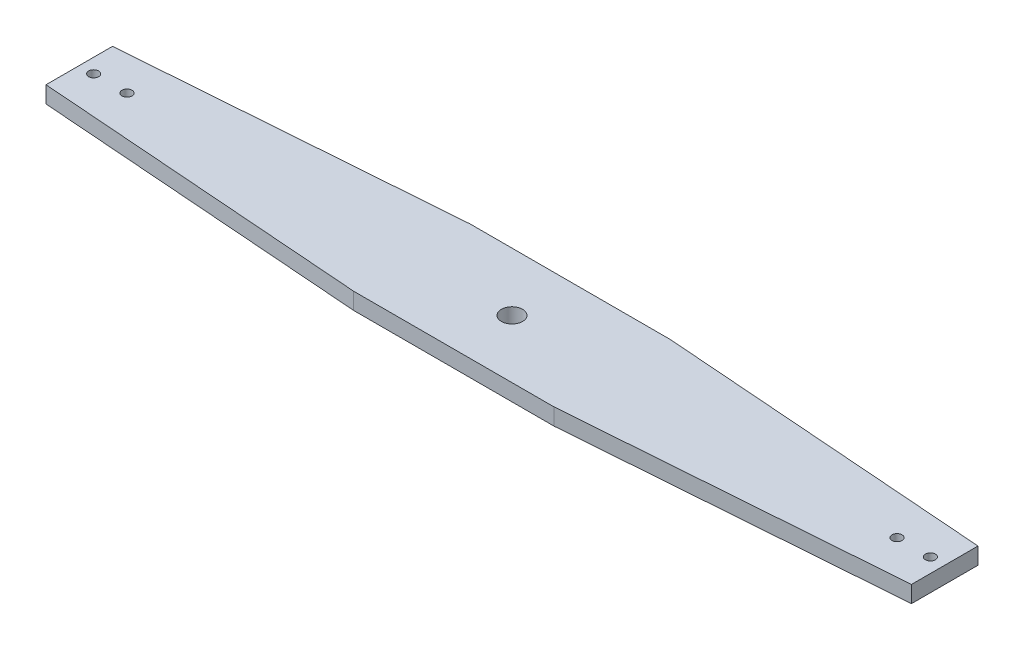
ISO-10303-21;
HEADER;
FILE_DESCRIPTION(('STEP AP214'),'2;1');
FILE_NAME('part.step','',(''),(''),'','','');
FILE_SCHEMA(('AUTOMOTIVE_DESIGN { 1 0 10303 214 1 1 1 1 }'));
ENDSEC;
DATA;
#1=APPLICATION_CONTEXT('core data for automotive mechanical design processes');
#2=APPLICATION_PROTOCOL_DEFINITION('international standard','automotive_design',2000,#1);
#3=PRODUCT_CONTEXT('',#1,'mechanical');
#4=PRODUCT('Part','Part','',(#3));
#5=PRODUCT_RELATED_PRODUCT_CATEGORY('part','',(#4));
#6=PRODUCT_DEFINITION_FORMATION('','',#4);
#7=PRODUCT_DEFINITION_CONTEXT('part definition',#1,'design');
#8=PRODUCT_DEFINITION('design','',#6,#7);
#9=PRODUCT_DEFINITION_SHAPE('','',#8);
#10=(LENGTH_UNIT() NAMED_UNIT(*) SI_UNIT(.MILLI.,.METRE.));
#11=(NAMED_UNIT(*) PLANE_ANGLE_UNIT() SI_UNIT($,.RADIAN.));
#12=(NAMED_UNIT(*) SI_UNIT($,.STERADIAN.) SOLID_ANGLE_UNIT());
#13=UNCERTAINTY_MEASURE_WITH_UNIT(LENGTH_MEASURE(1.E-05),#10,'distance_accuracy_value','');
#14=(GEOMETRIC_REPRESENTATION_CONTEXT(3) GLOBAL_UNCERTAINTY_ASSIGNED_CONTEXT((#13)) GLOBAL_UNIT_ASSIGNED_CONTEXT((#10,
#11,#12)) REPRESENTATION_CONTEXT('',''));
#15=CARTESIAN_POINT('',(0.,0.,0.));
#16=DIRECTION('',(0.,0.,1.));
#17=DIRECTION('',(1.,0.,0.));
#18=AXIS2_PLACEMENT_3D('',#15,#16,#17);
#19=CARTESIAN_POINT('',(0.,10.,0.));
#20=DIRECTION('',(0.,1.,0.));
#21=DIRECTION('',(0.,0.,1.));
#22=AXIS2_PLACEMENT_3D('',#19,#20,#21);
#23=PLANE('',#22);
#24=CARTESIAN_POINT('',(0.,10.,0.));
#25=DIRECTION('',(0.,1.,0.));
#26=DIRECTION('',(0.,0.,1.));
#27=AXIS2_PLACEMENT_3D('',#24,#25,#26);
#28=CIRCLE('',#27,6.34999999999999);
#29=CARTESIAN_POINT('',(0.,10.,6.34999999999999));
#30=VERTEX_POINT('',#29);
#31=EDGE_CURVE('E203',#30,#30,#28,.T.);
#32=ORIENTED_EDGE('',*,*,#31,.F.);
#33=EDGE_LOOP('',(#32));
#34=FACE_BOUND('',#33,.T.);
#35=CARTESIAN_POINT('',(250.825,10.,0.));
#36=DIRECTION('',(0.,1.,0.));
#37=DIRECTION('',(0.,0.,1.));
#38=AXIS2_PLACEMENT_3D('',#35,#36,#37);
#39=CIRCLE('',#38,2.99999999999999);
#40=CARTESIAN_POINT('',(250.825,10.,2.9999999999999));
#41=VERTEX_POINT('',#40);
#42=EDGE_CURVE('E191',#41,#41,#39,.T.);
#43=ORIENTED_EDGE('',*,*,#42,.F.);
#44=EDGE_LOOP('',(#43));
#45=FACE_BOUND('',#44,.T.);
#46=DIRECTION('',(-0.997190603750812,0.,0.0749059396249192));
#47=VECTOR('',#46,1.);
#48=CARTESIAN_POINT('',(-60.,10.,-34.9250000000001));
#49=LINE('',#48,#47);
#50=CARTESIAN_POINT('',(-60.,10.,-34.9250000000001));
#51=VERTEX_POINT('',#50);
#52=CARTESIAN_POINT('',(-259.438120750162,10.,-19.9438120750162));
#53=VERTEX_POINT('',#52);
#54=EDGE_CURVE('E154',#51,#53,#49,.T.);
#55=ORIENTED_EDGE('',*,*,#54,.T.);
#56=DIRECTION('',(0.,0.,1.));
#57=VECTOR('',#56,1.);
#58=CARTESIAN_POINT('',(-259.438120750162,10.,-19.9438120750162));
#59=LINE('',#58,#57);
#60=CARTESIAN_POINT('',(-259.438120750162,10.,19.9438120750162));
#61=VERTEX_POINT('',#60);
#62=EDGE_CURVE('E102',#53,#61,#59,.T.);
#63=ORIENTED_EDGE('',*,*,#62,.T.);
#64=DIRECTION('',(0.997190603750811,0.,0.0749059396249187));
#65=VECTOR('',#64,1.);
#66=CARTESIAN_POINT('',(-259.438120750162,10.,19.9438120750162));
#67=LINE('',#66,#65);
#68=CARTESIAN_POINT('',(-60.,10.,34.925));
#69=VERTEX_POINT('',#68);
#70=EDGE_CURVE('E169',#61,#69,#67,.T.);
#71=ORIENTED_EDGE('',*,*,#70,.T.);
#72=DIRECTION('',(1.,0.,0.));
#73=VECTOR('',#72,1.);
#74=CARTESIAN_POINT('',(-60.,10.,34.925));
#75=LINE('',#74,#73);
#76=CARTESIAN_POINT('',(60.,10.,34.925));
#77=VERTEX_POINT('',#76);
#78=EDGE_CURVE('E182',#69,#77,#75,.T.);
#79=ORIENTED_EDGE('',*,*,#78,.T.);
#80=DIRECTION('',(0.997190603750811,0.,-0.0749059396249172));
#81=VECTOR('',#80,1.);
#82=CARTESIAN_POINT('',(60.,10.,34.925));
#83=LINE('',#82,#81);
#84=CARTESIAN_POINT('',(259.438120750162,10.,19.9438120750165));
#85=VERTEX_POINT('',#84);
#86=EDGE_CURVE('E121',#77,#85,#83,.T.);
#87=ORIENTED_EDGE('',*,*,#86,.T.);
#88=DIRECTION('',(0.,0.,-1.));
#89=VECTOR('',#88,1.);
#90=CARTESIAN_POINT('',(259.438120750162,10.,-19.943812075016));
#91=LINE('',#90,#89);
#92=CARTESIAN_POINT('',(259.438120750162,10.,-19.943812075016));
#93=VERTEX_POINT('',#92);
#94=EDGE_CURVE('E115',#85,#93,#91,.T.);
#95=ORIENTED_EDGE('',*,*,#94,.T.);
#96=DIRECTION('',(-0.997190603750811,0.,-0.0749059396249203));
#97=VECTOR('',#96,1.);
#98=CARTESIAN_POINT('',(60.,10.,-34.9250000000001));
#99=LINE('',#98,#97);
#100=CARTESIAN_POINT('',(60.,10.,-34.9250000000001));
#101=VERTEX_POINT('',#100);
#102=EDGE_CURVE('E119',#93,#101,#99,.T.);
#103=ORIENTED_EDGE('',*,*,#102,.T.);
#104=DIRECTION('',(-1.,0.,0.));
#105=VECTOR('',#104,1.);
#106=CARTESIAN_POINT('',(-60.,10.,-34.9250000000001));
#107=LINE('',#106,#105);
#108=EDGE_CURVE('E59',#101,#51,#107,.T.);
#109=ORIENTED_EDGE('',*,*,#108,.T.);
#110=EDGE_LOOP('',(#55,#63,#71,#79,#87,#95,#103,#109));
#111=FACE_BOUND('',#110,.T.);
#112=CARTESIAN_POINT('',(-250.825,10.,0.));
#113=DIRECTION('',(0.,1.,0.));
#114=DIRECTION('',(0.,0.,1.));
#115=AXIS2_PLACEMENT_3D('',#112,#113,#114);
#116=CIRCLE('',#115,2.99999999999999);
#117=CARTESIAN_POINT('',(-250.825,10.,2.99999999999999));
#118=VERTEX_POINT('',#117);
#119=EDGE_CURVE('E143',#118,#118,#116,.T.);
#120=ORIENTED_EDGE('',*,*,#119,.F.);
#121=EDGE_LOOP('',(#120));
#122=FACE_BOUND('',#121,.T.);
#123=CARTESIAN_POINT('',(-230.825,10.,0.));
#124=DIRECTION('',(0.,1.,0.));
#125=DIRECTION('',(0.,0.,1.));
#126=AXIS2_PLACEMENT_3D('',#123,#124,#125);
#127=CIRCLE('',#126,2.99999999999999);
#128=CARTESIAN_POINT('',(-230.825,10.,2.99999999999999));
#129=VERTEX_POINT('',#128);
#130=EDGE_CURVE('E197',#129,#129,#127,.T.);
#131=ORIENTED_EDGE('',*,*,#130,.F.);
#132=EDGE_LOOP('',(#131));
#133=FACE_BOUND('',#132,.T.);
#134=CARTESIAN_POINT('',(230.825,10.,0.));
#135=DIRECTION('',(0.,1.,0.));
#136=DIRECTION('',(0.,0.,1.));
#137=AXIS2_PLACEMENT_3D('',#134,#135,#136);
#138=CIRCLE('',#137,2.99999999999999);
#139=CARTESIAN_POINT('',(230.825,10.,3.));
#140=VERTEX_POINT('',#139);
#141=EDGE_CURVE('E209',#140,#140,#138,.T.);
#142=ORIENTED_EDGE('',*,*,#141,.F.);
#143=EDGE_LOOP('',(#142));
#144=FACE_BOUND('',#143,.T.);
#145=ADVANCED_FACE('F42',(#34,#45,#111,#122,#133,#144),#23,.T.);
#146=CARTESIAN_POINT('',(0.,0.,0.));
#147=DIRECTION('',(0.,1.,0.));
#148=DIRECTION('',(0.,0.,1.));
#149=AXIS2_PLACEMENT_3D('',#146,#147,#148);
#150=PLANE('',#149);
#151=DIRECTION('',(-0.997190603750812,0.,0.0749059396249192));
#152=VECTOR('',#151,1.);
#153=CARTESIAN_POINT('',(-60.,0.,-34.9250000000001));
#154=LINE('',#153,#152);
#155=CARTESIAN_POINT('',(-60.,0.,-34.9250000000001));
#156=VERTEX_POINT('',#155);
#157=CARTESIAN_POINT('',(-259.438120750162,0.,-19.9438120750162));
#158=VERTEX_POINT('',#157);
#159=EDGE_CURVE('E139',#156,#158,#154,.T.);
#160=ORIENTED_EDGE('',*,*,#159,.F.);
#161=DIRECTION('',(-1.,0.,0.));
#162=VECTOR('',#161,1.);
#163=CARTESIAN_POINT('',(-60.,0.,-34.9250000000001));
#164=LINE('',#163,#162);
#165=CARTESIAN_POINT('',(60.,0.,-34.9250000000001));
#166=VERTEX_POINT('',#165);
#167=EDGE_CURVE('E94',#166,#156,#164,.T.);
#168=ORIENTED_EDGE('',*,*,#167,.F.);
#169=DIRECTION('',(-0.997190603750811,0.,-0.0749059396249203));
#170=VECTOR('',#169,1.);
#171=CARTESIAN_POINT('',(60.,0.,-34.9250000000001));
#172=LINE('',#171,#170);
#173=CARTESIAN_POINT('',(259.438120750162,0.,-19.943812075016));
#174=VERTEX_POINT('',#173);
#175=EDGE_CURVE('E88',#174,#166,#172,.T.);
#176=ORIENTED_EDGE('',*,*,#175,.F.);
#177=DIRECTION('',(0.,0.,-1.));
#178=VECTOR('',#177,1.);
#179=CARTESIAN_POINT('',(259.438120750162,0.,-19.943812075016));
#180=LINE('',#179,#178);
#181=CARTESIAN_POINT('',(259.438120750162,0.,19.9438120750165));
#182=VERTEX_POINT('',#181);
#183=EDGE_CURVE('E129',#182,#174,#180,.T.);
#184=ORIENTED_EDGE('',*,*,#183,.F.);
#185=DIRECTION('',(0.997190603750811,0.,-0.0749059396249172));
#186=VECTOR('',#185,1.);
#187=CARTESIAN_POINT('',(60.,0.,34.925));
#188=LINE('',#187,#186);
#189=CARTESIAN_POINT('',(60.,0.,34.925));
#190=VERTEX_POINT('',#189);
#191=EDGE_CURVE('E149',#190,#182,#188,.T.);
#192=ORIENTED_EDGE('',*,*,#191,.F.);
#193=DIRECTION('',(1.,0.,0.));
#194=VECTOR('',#193,1.);
#195=CARTESIAN_POINT('',(-60.,0.,34.925));
#196=LINE('',#195,#194);
#197=CARTESIAN_POINT('',(-60.,0.,34.925));
#198=VERTEX_POINT('',#197);
#199=EDGE_CURVE('E147',#198,#190,#196,.T.);
#200=ORIENTED_EDGE('',*,*,#199,.F.);
#201=DIRECTION('',(0.997190603750811,0.,0.0749059396249187));
#202=VECTOR('',#201,1.);
#203=CARTESIAN_POINT('',(-259.438120750162,0.,19.9438120750162));
#204=LINE('',#203,#202);
#205=CARTESIAN_POINT('',(-259.438120750162,0.,19.9438120750162));
#206=VERTEX_POINT('',#205);
#207=EDGE_CURVE('E145',#206,#198,#204,.T.);
#208=ORIENTED_EDGE('',*,*,#207,.F.);
#209=DIRECTION('',(0.,0.,1.));
#210=VECTOR('',#209,1.);
#211=CARTESIAN_POINT('',(-259.438120750162,0.,-19.9438120750162));
#212=LINE('',#211,#210);
#213=EDGE_CURVE('E142',#158,#206,#212,.T.);
#214=ORIENTED_EDGE('',*,*,#213,.F.);
#215=EDGE_LOOP('',(#160,#168,#176,#184,#192,#200,#208,#214));
#216=FACE_BOUND('',#215,.T.);
#217=CARTESIAN_POINT('',(-250.825,0.,0.));
#218=DIRECTION('',(0.,1.,0.));
#219=DIRECTION('',(0.,0.,1.));
#220=AXIS2_PLACEMENT_3D('',#217,#218,#219);
#221=CIRCLE('',#220,2.99999999999999);
#222=CARTESIAN_POINT('',(-250.825,0.,2.99999999999999));
#223=VERTEX_POINT('',#222);
#224=EDGE_CURVE('E188',#223,#223,#221,.T.);
#225=ORIENTED_EDGE('',*,*,#224,.T.);
#226=EDGE_LOOP('',(#225));
#227=FACE_BOUND('',#226,.T.);
#228=CARTESIAN_POINT('',(250.825,0.,0.));
#229=DIRECTION('',(0.,1.,0.));
#230=DIRECTION('',(0.,0.,1.));
#231=AXIS2_PLACEMENT_3D('',#228,#229,#230);
#232=CIRCLE('',#231,2.99999999999999);
#233=CARTESIAN_POINT('',(250.825,0.,2.9999999999999));
#234=VERTEX_POINT('',#233);
#235=EDGE_CURVE('E194',#234,#234,#232,.T.);
#236=ORIENTED_EDGE('',*,*,#235,.T.);
#237=EDGE_LOOP('',(#236));
#238=FACE_BOUND('',#237,.T.);
#239=CARTESIAN_POINT('',(-230.825,0.,0.));
#240=DIRECTION('',(0.,1.,0.));
#241=DIRECTION('',(0.,0.,1.));
#242=AXIS2_PLACEMENT_3D('',#239,#240,#241);
#243=CIRCLE('',#242,2.99999999999999);
#244=CARTESIAN_POINT('',(-230.825,0.,2.99999999999999));
#245=VERTEX_POINT('',#244);
#246=EDGE_CURVE('E200',#245,#245,#243,.T.);
#247=ORIENTED_EDGE('',*,*,#246,.T.);
#248=EDGE_LOOP('',(#247));
#249=FACE_BOUND('',#248,.T.);
#250=CARTESIAN_POINT('',(0.,0.,0.));
#251=DIRECTION('',(0.,1.,0.));
#252=DIRECTION('',(0.,0.,1.));
#253=AXIS2_PLACEMENT_3D('',#250,#251,#252);
#254=CIRCLE('',#253,6.34999999999999);
#255=CARTESIAN_POINT('',(0.,0.,6.34999999999999));
#256=VERTEX_POINT('',#255);
#257=EDGE_CURVE('E206',#256,#256,#254,.T.);
#258=ORIENTED_EDGE('',*,*,#257,.T.);
#259=EDGE_LOOP('',(#258));
#260=FACE_BOUND('',#259,.T.);
#261=CARTESIAN_POINT('',(230.825,0.,0.));
#262=DIRECTION('',(0.,1.,0.));
#263=DIRECTION('',(0.,0.,1.));
#264=AXIS2_PLACEMENT_3D('',#261,#262,#263);
#265=CIRCLE('',#264,2.99999999999999);
#266=CARTESIAN_POINT('',(230.825,0.,3.));
#267=VERTEX_POINT('',#266);
#268=EDGE_CURVE('E212',#267,#267,#265,.T.);
#269=ORIENTED_EDGE('',*,*,#268,.T.);
#270=EDGE_LOOP('',(#269));
#271=FACE_BOUND('',#270,.T.);
#272=ADVANCED_FACE('F173',(#216,#227,#238,#249,#260,#271),#150,.F.);
#273=CARTESIAN_POINT('',(-60.,10.,-34.9250000000001));
#274=DIRECTION('',(0.0749059396249192,0.,0.997190603750812));
#275=DIRECTION('',(0.997190603750812,0.,-0.0749059396249192));
#276=AXIS2_PLACEMENT_3D('',#273,#274,#275);
#277=PLANE('',#276);
#278=ORIENTED_EDGE('',*,*,#159,.T.);
#279=DIRECTION('',(0.,-1.,0.));
#280=VECTOR('',#279,1.);
#281=CARTESIAN_POINT('',(-259.438120750162,10.,-19.9438120750162));
#282=LINE('',#281,#280);
#283=EDGE_CURVE('E11',#53,#158,#282,.T.);
#284=ORIENTED_EDGE('',*,*,#283,.F.);
#285=ORIENTED_EDGE('',*,*,#54,.F.);
#286=DIRECTION('',(0.,-1.,0.));
#287=VECTOR('',#286,1.);
#288=CARTESIAN_POINT('',(-60.,10.,-34.9250000000001));
#289=LINE('',#288,#287);
#290=EDGE_CURVE('E135',#51,#156,#289,.T.);
#291=ORIENTED_EDGE('',*,*,#290,.T.);
#292=EDGE_LOOP('',(#278,#284,#285,#291));
#293=FACE_BOUND('',#292,.T.);
#294=ADVANCED_FACE('F44',(#293),#277,.F.);
#295=CARTESIAN_POINT('',(-259.438120750162,10.,-19.9438120750162));
#296=DIRECTION('',(1.,0.,0.));
#297=DIRECTION('',(0.,0.,-1.));
#298=AXIS2_PLACEMENT_3D('',#295,#296,#297);
#299=PLANE('',#298);
#300=ORIENTED_EDGE('',*,*,#213,.T.);
#301=DIRECTION('',(0.,-1.,0.));
#302=VECTOR('',#301,1.);
#303=CARTESIAN_POINT('',(-259.438120750162,10.,19.9438120750162));
#304=LINE('',#303,#302);
#305=EDGE_CURVE('E51',#61,#206,#304,.T.);
#306=ORIENTED_EDGE('',*,*,#305,.F.);
#307=ORIENTED_EDGE('',*,*,#62,.F.);
#308=ORIENTED_EDGE('',*,*,#283,.T.);
#309=EDGE_LOOP('',(#300,#306,#307,#308));
#310=FACE_BOUND('',#309,.T.);
#311=ADVANCED_FACE('F246',(#310),#299,.F.);
#312=CARTESIAN_POINT('',(-259.438120750162,10.,19.9438120750162));
#313=DIRECTION('',(0.0749059396249187,0.,-0.997190603750812));
#314=DIRECTION('',(-0.997190603750812,0.,-0.0749059396249187));
#315=AXIS2_PLACEMENT_3D('',#312,#313,#314);
#316=PLANE('',#315);
#317=ORIENTED_EDGE('',*,*,#207,.T.);
#318=DIRECTION('',(0.,-1.,0.));
#319=VECTOR('',#318,1.);
#320=CARTESIAN_POINT('',(-60.,10.,34.925));
#321=LINE('',#320,#319);
#322=EDGE_CURVE('E161',#69,#198,#321,.T.);
#323=ORIENTED_EDGE('',*,*,#322,.F.);
#324=ORIENTED_EDGE('',*,*,#70,.F.);
#325=ORIENTED_EDGE('',*,*,#305,.T.);
#326=EDGE_LOOP('',(#317,#323,#324,#325));
#327=FACE_BOUND('',#326,.T.);
#328=ADVANCED_FACE('F167',(#327),#316,.F.);
#329=CARTESIAN_POINT('',(-60.,10.,34.925));
#330=DIRECTION('',(0.,0.,-1.));
#331=DIRECTION('',(-1.,0.,0.));
#332=AXIS2_PLACEMENT_3D('',#329,#330,#331);
#333=PLANE('',#332);
#334=ORIENTED_EDGE('',*,*,#199,.T.);
#335=DIRECTION('',(0.,-1.,0.));
#336=VECTOR('',#335,1.);
#337=CARTESIAN_POINT('',(60.,10.,34.925));
#338=LINE('',#337,#336);
#339=EDGE_CURVE('E158',#77,#190,#338,.T.);
#340=ORIENTED_EDGE('',*,*,#339,.F.);
#341=ORIENTED_EDGE('',*,*,#78,.F.);
#342=ORIENTED_EDGE('',*,*,#322,.T.);
#343=EDGE_LOOP('',(#334,#340,#341,#342));
#344=FACE_BOUND('',#343,.T.);
#345=ADVANCED_FACE('F178',(#344),#333,.F.);
#346=CARTESIAN_POINT('',(60.,10.,34.925));
#347=DIRECTION('',(-0.0749059396249172,0.,-0.997190603750812));
#348=DIRECTION('',(-0.997190603750812,0.,0.0749059396249172));
#349=AXIS2_PLACEMENT_3D('',#346,#347,#348);
#350=PLANE('',#349);
#351=ORIENTED_EDGE('',*,*,#191,.T.);
#352=DIRECTION('',(0.,-1.,0.));
#353=VECTOR('',#352,1.);
#354=CARTESIAN_POINT('',(259.438120750162,10.,19.9438120750165));
#355=LINE('',#354,#353);
#356=EDGE_CURVE('E130',#85,#182,#355,.T.);
#357=ORIENTED_EDGE('',*,*,#356,.F.);
#358=ORIENTED_EDGE('',*,*,#86,.F.);
#359=ORIENTED_EDGE('',*,*,#339,.T.);
#360=EDGE_LOOP('',(#351,#357,#358,#359));
#361=FACE_BOUND('',#360,.T.);
#362=ADVANCED_FACE('F181',(#361),#350,.F.);
#363=CARTESIAN_POINT('',(259.438120750162,10.,-19.943812075016));
#364=DIRECTION('',(-1.,0.,0.));
#365=DIRECTION('',(0.,0.,1.));
#366=AXIS2_PLACEMENT_3D('',#363,#364,#365);
#367=PLANE('',#366);
#368=ORIENTED_EDGE('',*,*,#183,.T.);
#369=DIRECTION('',(0.,-1.,0.));
#370=VECTOR('',#369,1.);
#371=CARTESIAN_POINT('',(259.438120750162,10.,-19.943812075016));
#372=LINE('',#371,#370);
#373=EDGE_CURVE('E126',#93,#174,#372,.T.);
#374=ORIENTED_EDGE('',*,*,#373,.F.);
#375=ORIENTED_EDGE('',*,*,#94,.F.);
#376=ORIENTED_EDGE('',*,*,#356,.T.);
#377=EDGE_LOOP('',(#368,#374,#375,#376));
#378=FACE_BOUND('',#377,.T.);
#379=ADVANCED_FACE('F127',(#378),#367,.F.);
#380=CARTESIAN_POINT('',(60.,10.,-34.9250000000001));
#381=DIRECTION('',(-0.0749059396249203,0.,0.997190603750812));
#382=DIRECTION('',(0.997190603750811,0.,0.0749059396249203));
#383=AXIS2_PLACEMENT_3D('',#380,#381,#382);
#384=PLANE('',#383);
#385=ORIENTED_EDGE('',*,*,#175,.T.);
#386=DIRECTION('',(0.,-1.,0.));
#387=VECTOR('',#386,1.);
#388=CARTESIAN_POINT('',(60.,10.,-34.9250000000001));
#389=LINE('',#388,#387);
#390=EDGE_CURVE('E131',#101,#166,#389,.T.);
#391=ORIENTED_EDGE('',*,*,#390,.F.);
#392=ORIENTED_EDGE('',*,*,#102,.F.);
#393=ORIENTED_EDGE('',*,*,#373,.T.);
#394=EDGE_LOOP('',(#385,#391,#392,#393));
#395=FACE_BOUND('',#394,.T.);
#396=ADVANCED_FACE('F133',(#395),#384,.F.);
#397=CARTESIAN_POINT('',(-60.,10.,-34.9250000000001));
#398=DIRECTION('',(0.,0.,1.));
#399=DIRECTION('',(1.,0.,0.));
#400=AXIS2_PLACEMENT_3D('',#397,#398,#399);
#401=PLANE('',#400);
#402=ORIENTED_EDGE('',*,*,#167,.T.);
#403=ORIENTED_EDGE('',*,*,#290,.F.);
#404=ORIENTED_EDGE('',*,*,#108,.F.);
#405=ORIENTED_EDGE('',*,*,#390,.T.);
#406=EDGE_LOOP('',(#402,#403,#404,#405));
#407=FACE_BOUND('',#406,.T.);
#408=ADVANCED_FACE('F234',(#407),#401,.F.);
#409=CARTESIAN_POINT('',(-250.825,10.,0.));
#410=DIRECTION('',(0.,-1.,0.));
#411=DIRECTION('',(0.,0.,-1.));
#412=AXIS2_PLACEMENT_3D('',#409,#410,#411);
#413=CYLINDRICAL_SURFACE('',#412,2.99999999999999);
#414=ORIENTED_EDGE('',*,*,#119,.T.);
#415=EDGE_LOOP('',(#414));
#416=FACE_BOUND('',#415,.T.);
#417=ORIENTED_EDGE('',*,*,#224,.F.);
#418=EDGE_LOOP('',(#417));
#419=FACE_BOUND('',#418,.T.);
#420=ADVANCED_FACE('F231',(#416,#419),#413,.F.);
#421=CARTESIAN_POINT('',(250.825,10.,0.));
#422=DIRECTION('',(0.,-1.,0.));
#423=DIRECTION('',(0.,0.,-1.));
#424=AXIS2_PLACEMENT_3D('',#421,#422,#423);
#425=CYLINDRICAL_SURFACE('',#424,2.99999999999999);
#426=ORIENTED_EDGE('',*,*,#42,.T.);
#427=EDGE_LOOP('',(#426));
#428=FACE_BOUND('',#427,.T.);
#429=ORIENTED_EDGE('',*,*,#235,.F.);
#430=EDGE_LOOP('',(#429));
#431=FACE_BOUND('',#430,.T.);
#432=ADVANCED_FACE('F309',(#428,#431),#425,.F.);
#433=CARTESIAN_POINT('',(-230.825,10.,0.));
#434=DIRECTION('',(0.,-1.,0.));
#435=DIRECTION('',(0.,0.,-1.));
#436=AXIS2_PLACEMENT_3D('',#433,#434,#435);
#437=CYLINDRICAL_SURFACE('',#436,2.99999999999999);
#438=ORIENTED_EDGE('',*,*,#130,.T.);
#439=EDGE_LOOP('',(#438));
#440=FACE_BOUND('',#439,.T.);
#441=ORIENTED_EDGE('',*,*,#246,.F.);
#442=EDGE_LOOP('',(#441));
#443=FACE_BOUND('',#442,.T.);
#444=ADVANCED_FACE('F317',(#440,#443),#437,.F.);
#445=CARTESIAN_POINT('',(0.,10.,0.));
#446=DIRECTION('',(0.,-1.,0.));
#447=DIRECTION('',(0.,0.,-1.));
#448=AXIS2_PLACEMENT_3D('',#445,#446,#447);
#449=CYLINDRICAL_SURFACE('',#448,6.34999999999999);
#450=ORIENTED_EDGE('',*,*,#31,.T.);
#451=EDGE_LOOP('',(#450));
#452=FACE_BOUND('',#451,.T.);
#453=ORIENTED_EDGE('',*,*,#257,.F.);
#454=EDGE_LOOP('',(#453));
#455=FACE_BOUND('',#454,.T.);
#456=ADVANCED_FACE('F325',(#452,#455),#449,.F.);
#457=CARTESIAN_POINT('',(230.825,10.,0.));
#458=DIRECTION('',(0.,-1.,0.));
#459=DIRECTION('',(0.,0.,-1.));
#460=AXIS2_PLACEMENT_3D('',#457,#458,#459);
#461=CYLINDRICAL_SURFACE('',#460,2.99999999999999);
#462=ORIENTED_EDGE('',*,*,#141,.T.);
#463=EDGE_LOOP('',(#462));
#464=FACE_BOUND('',#463,.T.);
#465=ORIENTED_EDGE('',*,*,#268,.F.);
#466=EDGE_LOOP('',(#465));
#467=FACE_BOUND('',#466,.T.);
#468=ADVANCED_FACE('F218',(#464,#467),#461,.F.);
#469=CLOSED_SHELL('',(#145,#272,#294,#311,#328,#345,#362,#379,#396,#408,#420,#432,#444,#456,#468));
#470=MANIFOLD_SOLID_BREP('B2',#469);
#471=ADVANCED_BREP_SHAPE_REPRESENTATION('',(#18,#470),#14);
#472=SHAPE_DEFINITION_REPRESENTATION(#9,#471);
ENDSEC;
END-ISO-10303-21;
